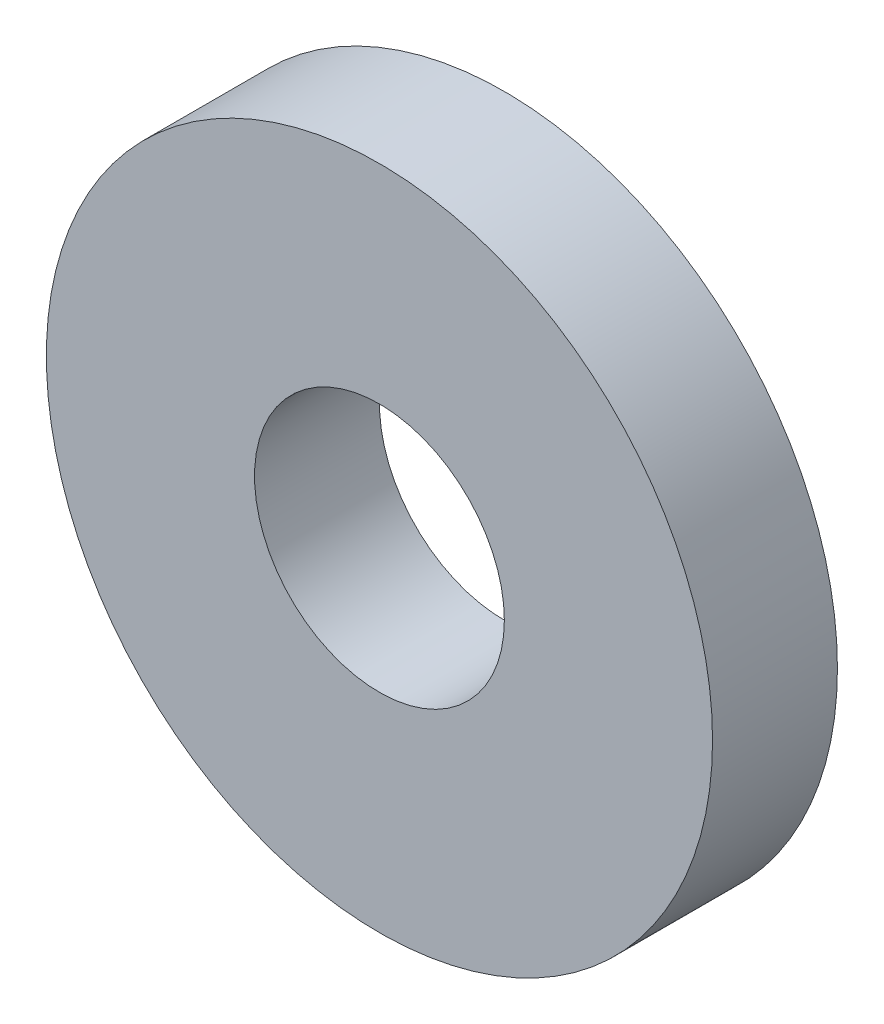
ISO-10303-21;
HEADER;
FILE_DESCRIPTION(('STEP AP214'),'2;1');
FILE_NAME('part.step','',(''),(''),'','','');
FILE_SCHEMA(('AUTOMOTIVE_DESIGN { 1 0 10303 214 1 1 1 1 }'));
ENDSEC;
DATA;
#1=APPLICATION_CONTEXT('core data for automotive mechanical design processes');
#2=APPLICATION_PROTOCOL_DEFINITION('international standard','automotive_design',2000,#1);
#3=PRODUCT_CONTEXT('',#1,'mechanical');
#4=PRODUCT('Part','Part','',(#3));
#5=PRODUCT_RELATED_PRODUCT_CATEGORY('part','',(#4));
#6=PRODUCT_DEFINITION_FORMATION('','',#4);
#7=PRODUCT_DEFINITION_CONTEXT('part definition',#1,'design');
#8=PRODUCT_DEFINITION('design','',#6,#7);
#9=PRODUCT_DEFINITION_SHAPE('','',#8);
#10=(LENGTH_UNIT() NAMED_UNIT(*) SI_UNIT(.MILLI.,.METRE.));
#11=(NAMED_UNIT(*) PLANE_ANGLE_UNIT() SI_UNIT($,.RADIAN.));
#12=(NAMED_UNIT(*) SI_UNIT($,.STERADIAN.) SOLID_ANGLE_UNIT());
#13=UNCERTAINTY_MEASURE_WITH_UNIT(LENGTH_MEASURE(1.E-05),#10,'distance_accuracy_value','');
#14=(GEOMETRIC_REPRESENTATION_CONTEXT(3) GLOBAL_UNCERTAINTY_ASSIGNED_CONTEXT((#13)) GLOBAL_UNIT_ASSIGNED_CONTEXT((#10,
#11,#12)) REPRESENTATION_CONTEXT('',''));
#15=CARTESIAN_POINT('',(0.,0.,0.));
#16=DIRECTION('',(0.,0.,1.));
#17=DIRECTION('',(1.,0.,0.));
#18=AXIS2_PLACEMENT_3D('',#15,#16,#17);
#19=CARTESIAN_POINT('',(0.,0.,15.));
#20=DIRECTION('',(0.,0.,1.));
#21=DIRECTION('',(1.,0.,0.));
#22=AXIS2_PLACEMENT_3D('',#19,#20,#21);
#23=PLANE('',#22);
#24=CARTESIAN_POINT('',(0.,0.,15.));
#25=DIRECTION('',(0.,0.,1.));
#26=DIRECTION('',(1.,0.,0.));
#27=AXIS2_PLACEMENT_3D('',#24,#25,#26);
#28=CIRCLE('',#27,40.);
#29=CARTESIAN_POINT('',(40.,0.,15.));
#30=VERTEX_POINT('',#29);
#31=EDGE_CURVE('E10',#30,#30,#28,.T.);
#32=ORIENTED_EDGE('',*,*,#31,.T.);
#33=EDGE_LOOP('',(#32));
#34=FACE_BOUND('',#33,.T.);
#35=CARTESIAN_POINT('',(0.,0.,15.));
#36=DIRECTION('',(0.,0.,1.));
#37=DIRECTION('',(1.,0.,0.));
#38=AXIS2_PLACEMENT_3D('',#35,#36,#37);
#39=CIRCLE('',#38,15.);
#40=CARTESIAN_POINT('',(15.,0.,15.));
#41=VERTEX_POINT('',#40);
#42=EDGE_CURVE('E42',#41,#41,#39,.T.);
#43=ORIENTED_EDGE('',*,*,#42,.F.);
#44=EDGE_LOOP('',(#43));
#45=FACE_BOUND('',#44,.T.);
#46=ADVANCED_FACE('F31',(#34,#45),#23,.T.);
#47=CARTESIAN_POINT('',(0.,0.,0.));
#48=DIRECTION('',(0.,0.,1.));
#49=DIRECTION('',(1.,0.,0.));
#50=AXIS2_PLACEMENT_3D('',#47,#48,#49);
#51=PLANE('',#50);
#52=CARTESIAN_POINT('',(0.,0.,0.));
#53=DIRECTION('',(0.,0.,1.));
#54=DIRECTION('',(1.,0.,0.));
#55=AXIS2_PLACEMENT_3D('',#52,#53,#54);
#56=CIRCLE('',#55,40.);
#57=CARTESIAN_POINT('',(40.,0.,0.));
#58=VERTEX_POINT('',#57);
#59=EDGE_CURVE('E35',#58,#58,#56,.T.);
#60=ORIENTED_EDGE('',*,*,#59,.F.);
#61=EDGE_LOOP('',(#60));
#62=FACE_BOUND('',#61,.T.);
#63=CARTESIAN_POINT('',(0.,0.,0.));
#64=DIRECTION('',(0.,0.,1.));
#65=DIRECTION('',(1.,0.,0.));
#66=AXIS2_PLACEMENT_3D('',#63,#64,#65);
#67=CIRCLE('',#66,15.);
#68=CARTESIAN_POINT('',(15.,0.,0.));
#69=VERTEX_POINT('',#68);
#70=EDGE_CURVE('E44',#69,#69,#67,.T.);
#71=ORIENTED_EDGE('',*,*,#70,.T.);
#72=EDGE_LOOP('',(#71));
#73=FACE_BOUND('',#72,.T.);
#74=ADVANCED_FACE('F54',(#62,#73),#51,.F.);
#75=CARTESIAN_POINT('',(0.,0.,15.));
#76=DIRECTION('',(0.,0.,-1.));
#77=DIRECTION('',(-1.,0.,0.));
#78=AXIS2_PLACEMENT_3D('',#75,#76,#77);
#79=CYLINDRICAL_SURFACE('',#78,40.);
#80=ORIENTED_EDGE('',*,*,#31,.F.);
#81=EDGE_LOOP('',(#80));
#82=FACE_BOUND('',#81,.T.);
#83=ORIENTED_EDGE('',*,*,#59,.T.);
#84=EDGE_LOOP('',(#83));
#85=FACE_BOUND('',#84,.T.);
#86=ADVANCED_FACE('F33',(#82,#85),#79,.T.);
#87=CARTESIAN_POINT('',(0.,0.,15.));
#88=DIRECTION('',(0.,0.,-1.));
#89=DIRECTION('',(-1.,0.,0.));
#90=AXIS2_PLACEMENT_3D('',#87,#88,#89);
#91=CYLINDRICAL_SURFACE('',#90,15.);
#92=ORIENTED_EDGE('',*,*,#42,.T.);
#93=EDGE_LOOP('',(#92));
#94=FACE_BOUND('',#93,.T.);
#95=ORIENTED_EDGE('',*,*,#70,.F.);
#96=EDGE_LOOP('',(#95));
#97=FACE_BOUND('',#96,.T.);
#98=ADVANCED_FACE('F50',(#94,#97),#91,.F.);
#99=CLOSED_SHELL('',(#46,#74,#86,#98));
#100=MANIFOLD_SOLID_BREP('B2',#99);
#101=ADVANCED_BREP_SHAPE_REPRESENTATION('',(#18,#100),#14);
#102=SHAPE_DEFINITION_REPRESENTATION(#9,#101);
ENDSEC;
END-ISO-10303-21;
